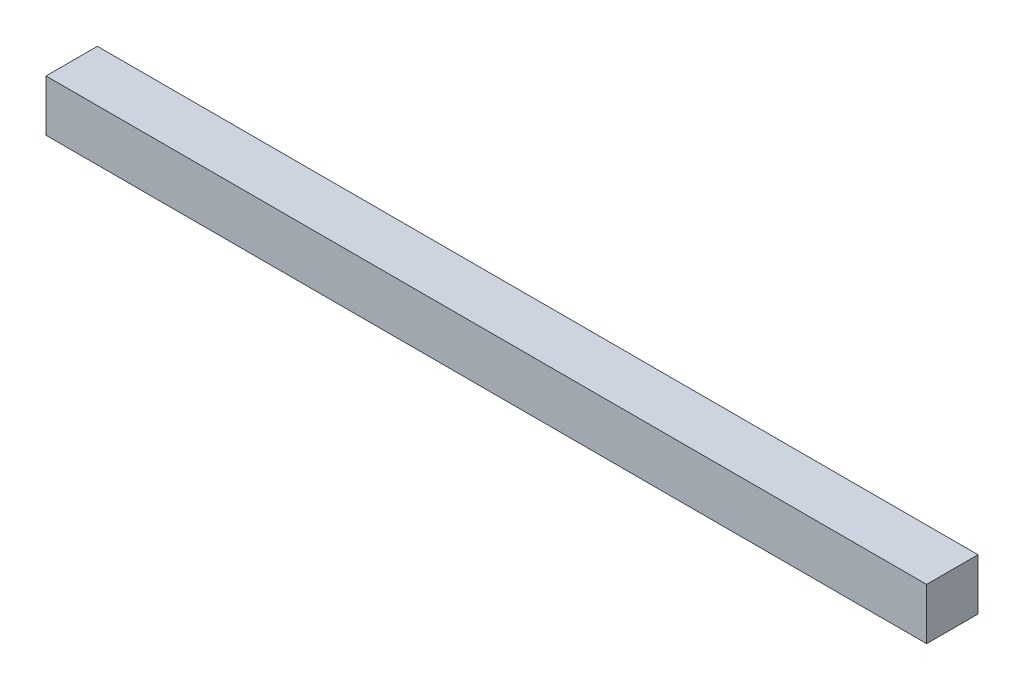
ISO-10303-21;
HEADER;
FILE_DESCRIPTION(('STEP AP214'),'2;1');
FILE_NAME('part.step','',(''),(''),'','','');
FILE_SCHEMA(('AUTOMOTIVE_DESIGN { 1 0 10303 214 1 1 1 1 }'));
ENDSEC;
DATA;
#1=APPLICATION_CONTEXT('core data for automotive mechanical design processes');
#2=APPLICATION_PROTOCOL_DEFINITION('international standard','automotive_design',2000,#1);
#3=PRODUCT_CONTEXT('',#1,'mechanical');
#4=PRODUCT('Part','Part','',(#3));
#5=PRODUCT_RELATED_PRODUCT_CATEGORY('part','',(#4));
#6=PRODUCT_DEFINITION_FORMATION('','',#4);
#7=PRODUCT_DEFINITION_CONTEXT('part definition',#1,'design');
#8=PRODUCT_DEFINITION('design','',#6,#7);
#9=PRODUCT_DEFINITION_SHAPE('','',#8);
#10=(LENGTH_UNIT() NAMED_UNIT(*) SI_UNIT(.MILLI.,.METRE.));
#11=(NAMED_UNIT(*) PLANE_ANGLE_UNIT() SI_UNIT($,.RADIAN.));
#12=(NAMED_UNIT(*) SI_UNIT($,.STERADIAN.) SOLID_ANGLE_UNIT());
#13=UNCERTAINTY_MEASURE_WITH_UNIT(LENGTH_MEASURE(1.E-05),#10,'distance_accuracy_value','');
#14=(GEOMETRIC_REPRESENTATION_CONTEXT(3) GLOBAL_UNCERTAINTY_ASSIGNED_CONTEXT((#13)) GLOBAL_UNIT_ASSIGNED_CONTEXT((#10,
#11,#12)) REPRESENTATION_CONTEXT('',''));
#15=CARTESIAN_POINT('',(0.,0.,0.));
#16=DIRECTION('',(0.,0.,1.));
#17=DIRECTION('',(1.,0.,0.));
#18=AXIS2_PLACEMENT_3D('',#15,#16,#17);
#19=CARTESIAN_POINT('',(-381.,22.225,-22.225));
#20=DIRECTION('',(0.,0.,-1.));
#21=DIRECTION('',(0.,1.,0.));
#22=AXIS2_PLACEMENT_3D('',#19,#20,#21);
#23=PLANE('',#22);
#24=DIRECTION('',(1.,0.,0.));
#25=VECTOR('',#24,1.);
#26=CARTESIAN_POINT('',(-381.,22.225,-22.225));
#27=LINE('',#26,#25);
#28=CARTESIAN_POINT('',(-381.,22.225,-22.225));
#29=VERTEX_POINT('',#28);
#30=CARTESIAN_POINT('',(381.,22.225,-22.225));
#31=VERTEX_POINT('',#30);
#32=EDGE_CURVE('E46',#29,#31,#27,.T.);
#33=ORIENTED_EDGE('',*,*,#32,.T.);
#34=DIRECTION('',(0.,1.,0.));
#35=VECTOR('',#34,1.);
#36=CARTESIAN_POINT('',(381.,22.225,-22.225));
#37=LINE('',#36,#35);
#38=CARTESIAN_POINT('',(381.,-22.225,-22.225));
#39=VERTEX_POINT('',#38);
#40=EDGE_CURVE('E84',#39,#31,#37,.T.);
#41=ORIENTED_EDGE('',*,*,#40,.F.);
#42=DIRECTION('',(1.,0.,0.));
#43=VECTOR('',#42,1.);
#44=CARTESIAN_POINT('',(-381.,-22.225,-22.225));
#45=LINE('',#44,#43);
#46=CARTESIAN_POINT('',(-381.,-22.225,-22.225));
#47=VERTEX_POINT('',#46);
#48=EDGE_CURVE('E11',#47,#39,#45,.T.);
#49=ORIENTED_EDGE('',*,*,#48,.F.);
#50=DIRECTION('',(0.,1.,0.));
#51=VECTOR('',#50,1.);
#52=CARTESIAN_POINT('',(-381.,22.225,-22.225));
#53=LINE('',#52,#51);
#54=EDGE_CURVE('E85',#47,#29,#53,.T.);
#55=ORIENTED_EDGE('',*,*,#54,.T.);
#56=EDGE_LOOP('',(#33,#41,#49,#55));
#57=FACE_BOUND('',#56,.T.);
#58=ADVANCED_FACE('F43',(#57),#23,.T.);
#59=CARTESIAN_POINT('',(-381.,-22.225,22.225));
#60=DIRECTION('',(0.,-1.,0.));
#61=DIRECTION('',(0.,0.,-1.));
#62=AXIS2_PLACEMENT_3D('',#59,#60,#61);
#63=PLANE('',#62);
#64=ORIENTED_EDGE('',*,*,#48,.T.);
#65=DIRECTION('',(0.,0.,-1.));
#66=VECTOR('',#65,1.);
#67=CARTESIAN_POINT('',(381.,-22.225,22.225));
#68=LINE('',#67,#66);
#69=CARTESIAN_POINT('',(381.,-22.225,22.225));
#70=VERTEX_POINT('',#69);
#71=EDGE_CURVE('E103',#70,#39,#68,.T.);
#72=ORIENTED_EDGE('',*,*,#71,.F.);
#73=DIRECTION('',(1.,0.,0.));
#74=VECTOR('',#73,1.);
#75=CARTESIAN_POINT('',(-381.,-22.225,22.225));
#76=LINE('',#75,#74);
#77=CARTESIAN_POINT('',(-381.,-22.225,22.225));
#78=VERTEX_POINT('',#77);
#79=EDGE_CURVE('E52',#78,#70,#76,.T.);
#80=ORIENTED_EDGE('',*,*,#79,.F.);
#81=DIRECTION('',(0.,0.,-1.));
#82=VECTOR('',#81,1.);
#83=CARTESIAN_POINT('',(-381.,-22.225,22.225));
#84=LINE('',#83,#82);
#85=EDGE_CURVE('E91',#78,#47,#84,.T.);
#86=ORIENTED_EDGE('',*,*,#85,.T.);
#87=EDGE_LOOP('',(#64,#72,#80,#86));
#88=FACE_BOUND('',#87,.T.);
#89=ADVANCED_FACE('F127',(#88),#63,.T.);
#90=CARTESIAN_POINT('',(-381.,22.225,22.225));
#91=DIRECTION('',(0.,0.,1.));
#92=DIRECTION('',(0.,-1.,0.));
#93=AXIS2_PLACEMENT_3D('',#90,#91,#92);
#94=PLANE('',#93);
#95=ORIENTED_EDGE('',*,*,#79,.T.);
#96=DIRECTION('',(0.,-1.,0.));
#97=VECTOR('',#96,1.);
#98=CARTESIAN_POINT('',(381.,22.225,22.225));
#99=LINE('',#98,#97);
#100=CARTESIAN_POINT('',(381.,22.225,22.225));
#101=VERTEX_POINT('',#100);
#102=EDGE_CURVE('E99',#101,#70,#99,.T.);
#103=ORIENTED_EDGE('',*,*,#102,.F.);
#104=DIRECTION('',(1.,0.,0.));
#105=VECTOR('',#104,1.);
#106=CARTESIAN_POINT('',(-381.,22.225,22.225));
#107=LINE('',#106,#105);
#108=CARTESIAN_POINT('',(-381.,22.225,22.225));
#109=VERTEX_POINT('',#108);
#110=EDGE_CURVE('E90',#109,#101,#107,.T.);
#111=ORIENTED_EDGE('',*,*,#110,.F.);
#112=DIRECTION('',(0.,-1.,0.));
#113=VECTOR('',#112,1.);
#114=CARTESIAN_POINT('',(-381.,22.225,22.225));
#115=LINE('',#114,#113);
#116=EDGE_CURVE('E116',#109,#78,#115,.T.);
#117=ORIENTED_EDGE('',*,*,#116,.T.);
#118=EDGE_LOOP('',(#95,#103,#111,#117));
#119=FACE_BOUND('',#118,.T.);
#120=ADVANCED_FACE('F124',(#119),#94,.T.);
#121=CARTESIAN_POINT('',(-381.,22.225,22.225));
#122=DIRECTION('',(0.,1.,0.));
#123=DIRECTION('',(0.,0.,1.));
#124=AXIS2_PLACEMENT_3D('',#121,#122,#123);
#125=PLANE('',#124);
#126=ORIENTED_EDGE('',*,*,#110,.T.);
#127=DIRECTION('',(0.,0.,1.));
#128=VECTOR('',#127,1.);
#129=CARTESIAN_POINT('',(381.,22.225,22.225));
#130=LINE('',#129,#128);
#131=EDGE_CURVE('E93',#31,#101,#130,.T.);
#132=ORIENTED_EDGE('',*,*,#131,.F.);
#133=ORIENTED_EDGE('',*,*,#32,.F.);
#134=DIRECTION('',(0.,0.,1.));
#135=VECTOR('',#134,1.);
#136=CARTESIAN_POINT('',(-381.,22.225,22.225));
#137=LINE('',#136,#135);
#138=EDGE_CURVE('E113',#29,#109,#137,.T.);
#139=ORIENTED_EDGE('',*,*,#138,.T.);
#140=EDGE_LOOP('',(#126,#132,#133,#139));
#141=FACE_BOUND('',#140,.T.);
#142=ADVANCED_FACE('F94',(#141),#125,.T.);
#143=CARTESIAN_POINT('',(-381.,0.,0.));
#144=DIRECTION('',(1.,0.,0.));
#145=DIRECTION('',(0.,0.,-1.));
#146=AXIS2_PLACEMENT_3D('',#143,#144,#145);
#147=PLANE('',#146);
#148=ORIENTED_EDGE('',*,*,#54,.F.);
#149=ORIENTED_EDGE('',*,*,#85,.F.);
#150=ORIENTED_EDGE('',*,*,#116,.F.);
#151=ORIENTED_EDGE('',*,*,#138,.F.);
#152=EDGE_LOOP('',(#148,#149,#150,#151));
#153=FACE_BOUND('',#152,.T.);
#154=ADVANCED_FACE('F129',(#153),#147,.F.);
#155=CARTESIAN_POINT('',(381.,0.,0.));
#156=DIRECTION('',(1.,0.,0.));
#157=DIRECTION('',(0.,0.,-1.));
#158=AXIS2_PLACEMENT_3D('',#155,#156,#157);
#159=PLANE('',#158);
#160=ORIENTED_EDGE('',*,*,#40,.T.);
#161=ORIENTED_EDGE('',*,*,#131,.T.);
#162=ORIENTED_EDGE('',*,*,#102,.T.);
#163=ORIENTED_EDGE('',*,*,#71,.T.);
#164=EDGE_LOOP('',(#160,#161,#162,#163));
#165=FACE_BOUND('',#164,.T.);
#166=ADVANCED_FACE('F102',(#165),#159,.T.);
#167=CLOSED_SHELL('',(#58,#89,#120,#142,#154,#166));
#168=MANIFOLD_SOLID_BREP('B2',#167);
#169=ADVANCED_BREP_SHAPE_REPRESENTATION('',(#18,#168),#14);
#170=SHAPE_DEFINITION_REPRESENTATION(#9,#169);
ENDSEC;
END-ISO-10303-21;
